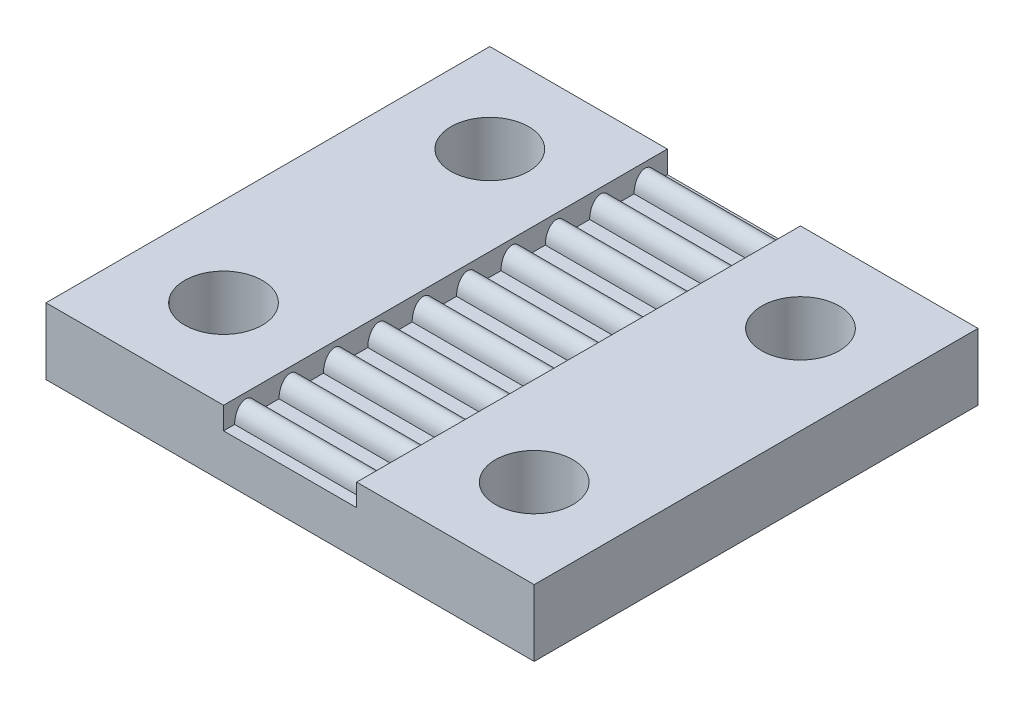
ISO-10303-21;
HEADER;
FILE_DESCRIPTION(('STEP AP214'),'2;1');
FILE_NAME('part.step','',(''),(''),'','','');
FILE_SCHEMA(('AUTOMOTIVE_DESIGN { 1 0 10303 214 1 1 1 1 }'));
ENDSEC;
DATA;
#1=APPLICATION_CONTEXT('core data for automotive mechanical design processes');
#2=APPLICATION_PROTOCOL_DEFINITION('international standard','automotive_design',2000,#1);
#3=PRODUCT_CONTEXT('',#1,'mechanical');
#4=PRODUCT('Part','Part','',(#3));
#5=PRODUCT_RELATED_PRODUCT_CATEGORY('part','',(#4));
#6=PRODUCT_DEFINITION_FORMATION('','',#4);
#7=PRODUCT_DEFINITION_CONTEXT('part definition',#1,'design');
#8=PRODUCT_DEFINITION('design','',#6,#7);
#9=PRODUCT_DEFINITION_SHAPE('','',#8);
#10=(LENGTH_UNIT() NAMED_UNIT(*) SI_UNIT(.MILLI.,.METRE.));
#11=(NAMED_UNIT(*) PLANE_ANGLE_UNIT() SI_UNIT($,.RADIAN.));
#12=(NAMED_UNIT(*) SI_UNIT($,.STERADIAN.) SOLID_ANGLE_UNIT());
#13=UNCERTAINTY_MEASURE_WITH_UNIT(LENGTH_MEASURE(1.E-05),#10,'distance_accuracy_value','');
#14=(GEOMETRIC_REPRESENTATION_CONTEXT(3) GLOBAL_UNCERTAINTY_ASSIGNED_CONTEXT((#13)) GLOBAL_UNIT_ASSIGNED_CONTEXT((#10,
#11,#12)) REPRESENTATION_CONTEXT('',''));
#15=CARTESIAN_POINT('',(0.,0.,0.));
#16=DIRECTION('',(0.,0.,1.));
#17=DIRECTION('',(1.,0.,0.));
#18=AXIS2_PLACEMENT_3D('',#15,#16,#17);
#19=CARTESIAN_POINT('',(-3.,0.,10.));
#20=DIRECTION('',(0.,-1.,0.));
#21=DIRECTION('',(0.,0.,-1.));
#22=AXIS2_PLACEMENT_3D('',#19,#20,#21);
#23=PLANE('',#22);
#24=DIRECTION('',(-1.,0.,0.));
#25=VECTOR('',#24,1.);
#26=CARTESIAN_POINT('',(0.,0.,8.5));
#27=LINE('',#26,#25);
#28=CARTESIAN_POINT('',(3.,0.,8.5));
#29=VERTEX_POINT('',#28);
#30=CARTESIAN_POINT('',(-3.,0.,8.5));
#31=VERTEX_POINT('',#30);
#32=EDGE_CURVE('E50',#29,#31,#27,.T.);
#33=ORIENTED_EDGE('',*,*,#32,.F.);
#34=DIRECTION('',(0.,0.,-1.));
#35=VECTOR('',#34,1.);
#36=CARTESIAN_POINT('',(3.,0.,10.));
#37=LINE('',#36,#35);
#38=CARTESIAN_POINT('',(3.,0.,7.5));
#39=VERTEX_POINT('',#38);
#40=EDGE_CURVE('E413',#29,#39,#37,.T.);
#41=ORIENTED_EDGE('',*,*,#40,.T.);
#42=DIRECTION('',(-1.,0.,0.));
#43=VECTOR('',#42,1.);
#44=CARTESIAN_POINT('',(0.,0.,7.5));
#45=LINE('',#44,#43);
#46=CARTESIAN_POINT('',(-3.,0.,7.5));
#47=VERTEX_POINT('',#46);
#48=EDGE_CURVE('E243',#47,#39,#45,.F.);
#49=ORIENTED_EDGE('',*,*,#48,.F.);
#50=DIRECTION('',(0.,0.,-1.));
#51=VECTOR('',#50,1.);
#52=CARTESIAN_POINT('',(-3.,0.,10.));
#53=LINE('',#52,#51);
#54=EDGE_CURVE('E230',#31,#47,#53,.T.);
#55=ORIENTED_EDGE('',*,*,#54,.F.);
#56=EDGE_LOOP('',(#33,#41,#49,#55));
#57=FACE_BOUND('',#56,.T.);
#58=ADVANCED_FACE('F35',(#57),#23,.F.);
#59=DIRECTION('',(-1.,0.,0.));
#60=VECTOR('',#59,1.);
#61=CARTESIAN_POINT('',(0.,0.,9.5));
#62=LINE('',#61,#60);
#63=CARTESIAN_POINT('',(-3.,0.,9.5));
#64=VERTEX_POINT('',#63);
#65=CARTESIAN_POINT('',(3.,0.,9.5));
#66=VERTEX_POINT('',#65);
#67=EDGE_CURVE('E234',#64,#66,#62,.F.);
#68=ORIENTED_EDGE('',*,*,#67,.F.);
#69=CARTESIAN_POINT('',(-3.,0.,10.));
#70=VERTEX_POINT('',#69);
#71=EDGE_CURVE('E222',#70,#64,#53,.T.);
#72=ORIENTED_EDGE('',*,*,#71,.F.);
#73=DIRECTION('',(-1.,0.,0.));
#74=VECTOR('',#73,1.);
#75=CARTESIAN_POINT('',(-3.,0.,10.));
#76=LINE('',#75,#74);
#77=CARTESIAN_POINT('',(3.,0.,10.));
#78=VERTEX_POINT('',#77);
#79=EDGE_CURVE('E367',#78,#70,#76,.T.);
#80=ORIENTED_EDGE('',*,*,#79,.F.);
#81=EDGE_CURVE('E236',#78,#66,#37,.T.);
#82=ORIENTED_EDGE('',*,*,#81,.T.);
#83=EDGE_LOOP('',(#68,#72,#80,#82));
#84=FACE_BOUND('',#83,.T.);
#85=ADVANCED_FACE('F235',(#84),#23,.F.);
#86=DIRECTION('',(-1.,0.,0.));
#87=VECTOR('',#86,1.);
#88=CARTESIAN_POINT('',(0.,0.,6.5));
#89=LINE('',#88,#87);
#90=CARTESIAN_POINT('',(3.,0.,6.5));
#91=VERTEX_POINT('',#90);
#92=CARTESIAN_POINT('',(-3.,0.,6.5));
#93=VERTEX_POINT('',#92);
#94=EDGE_CURVE('E445',#91,#93,#89,.T.);
#95=ORIENTED_EDGE('',*,*,#94,.F.);
#96=CARTESIAN_POINT('',(3.,0.,5.5));
#97=VERTEX_POINT('',#96);
#98=EDGE_CURVE('E805',#91,#97,#37,.T.);
#99=ORIENTED_EDGE('',*,*,#98,.T.);
#100=DIRECTION('',(-1.,0.,0.));
#101=VECTOR('',#100,1.);
#102=CARTESIAN_POINT('',(0.,0.,5.5));
#103=LINE('',#102,#101);
#104=CARTESIAN_POINT('',(-3.,0.,5.5));
#105=VERTEX_POINT('',#104);
#106=EDGE_CURVE('E269',#105,#97,#103,.F.);
#107=ORIENTED_EDGE('',*,*,#106,.F.);
#108=EDGE_CURVE('E447',#93,#105,#53,.T.);
#109=ORIENTED_EDGE('',*,*,#108,.F.);
#110=EDGE_LOOP('',(#95,#99,#107,#109));
#111=FACE_BOUND('',#110,.T.);
#112=ADVANCED_FACE('F450',(#111),#23,.F.);
#113=DIRECTION('',(-1.,0.,0.));
#114=VECTOR('',#113,1.);
#115=CARTESIAN_POINT('',(0.,0.,4.5));
#116=LINE('',#115,#114);
#117=CARTESIAN_POINT('',(3.,0.,4.5));
#118=VERTEX_POINT('',#117);
#119=CARTESIAN_POINT('',(-3.,0.,4.5));
#120=VERTEX_POINT('',#119);
#121=EDGE_CURVE('E272',#118,#120,#116,.T.);
#122=ORIENTED_EDGE('',*,*,#121,.F.);
#123=CARTESIAN_POINT('',(3.,0.,3.5));
#124=VERTEX_POINT('',#123);
#125=EDGE_CURVE('E493',#118,#124,#37,.T.);
#126=ORIENTED_EDGE('',*,*,#125,.T.);
#127=DIRECTION('',(-1.,0.,0.));
#128=VECTOR('',#127,1.);
#129=CARTESIAN_POINT('',(0.,0.,3.5));
#130=LINE('',#129,#128);
#131=CARTESIAN_POINT('',(-3.,0.,3.5));
#132=VERTEX_POINT('',#131);
#133=EDGE_CURVE('E277',#132,#124,#130,.F.);
#134=ORIENTED_EDGE('',*,*,#133,.F.);
#135=EDGE_CURVE('E452',#120,#132,#53,.T.);
#136=ORIENTED_EDGE('',*,*,#135,.F.);
#137=EDGE_LOOP('',(#122,#126,#134,#136));
#138=FACE_BOUND('',#137,.T.);
#139=ADVANCED_FACE('F564',(#138),#23,.F.);
#140=DIRECTION('',(-1.,0.,0.));
#141=VECTOR('',#140,1.);
#142=CARTESIAN_POINT('',(0.,0.,2.5));
#143=LINE('',#142,#141);
#144=CARTESIAN_POINT('',(3.,0.,2.5));
#145=VERTEX_POINT('',#144);
#146=CARTESIAN_POINT('',(-3.,0.,2.5));
#147=VERTEX_POINT('',#146);
#148=EDGE_CURVE('E282',#145,#147,#143,.T.);
#149=ORIENTED_EDGE('',*,*,#148,.F.);
#150=CARTESIAN_POINT('',(3.,0.,1.5));
#151=VERTEX_POINT('',#150);
#152=EDGE_CURVE('E492',#145,#151,#37,.T.);
#153=ORIENTED_EDGE('',*,*,#152,.T.);
#154=DIRECTION('',(-1.,0.,0.));
#155=VECTOR('',#154,1.);
#156=CARTESIAN_POINT('',(0.,0.,1.5));
#157=LINE('',#156,#155);
#158=CARTESIAN_POINT('',(-3.,0.,1.5));
#159=VERTEX_POINT('',#158);
#160=EDGE_CURVE('E352',#159,#151,#157,.F.);
#161=ORIENTED_EDGE('',*,*,#160,.F.);
#162=EDGE_CURVE('E453',#147,#159,#53,.T.);
#163=ORIENTED_EDGE('',*,*,#162,.F.);
#164=EDGE_LOOP('',(#149,#153,#161,#163));
#165=FACE_BOUND('',#164,.T.);
#166=ADVANCED_FACE('F558',(#165),#23,.F.);
#167=DIRECTION('',(-1.,0.,0.));
#168=VECTOR('',#167,1.);
#169=CARTESIAN_POINT('',(0.,0.,-9.5));
#170=LINE('',#169,#168);
#171=CARTESIAN_POINT('',(3.,0.,-9.5));
#172=VERTEX_POINT('',#171);
#173=CARTESIAN_POINT('',(-3.,0.,-9.5));
#174=VERTEX_POINT('',#173);
#175=EDGE_CURVE('E510',#172,#174,#170,.T.);
#176=ORIENTED_EDGE('',*,*,#175,.F.);
#177=CARTESIAN_POINT('',(3.,0.,-10.));
#178=VERTEX_POINT('',#177);
#179=EDGE_CURVE('E229',#172,#178,#37,.T.);
#180=ORIENTED_EDGE('',*,*,#179,.T.);
#181=DIRECTION('',(-1.,0.,0.));
#182=VECTOR('',#181,1.);
#183=CARTESIAN_POINT('',(-3.,0.,-10.));
#184=LINE('',#183,#182);
#185=CARTESIAN_POINT('',(-3.,0.,-10.));
#186=VERTEX_POINT('',#185);
#187=EDGE_CURVE('E384',#178,#186,#184,.T.);
#188=ORIENTED_EDGE('',*,*,#187,.T.);
#189=EDGE_CURVE('E409',#174,#186,#53,.T.);
#190=ORIENTED_EDGE('',*,*,#189,.F.);
#191=EDGE_LOOP('',(#176,#180,#188,#190));
#192=FACE_BOUND('',#191,.T.);
#193=ADVANCED_FACE('F506',(#192),#23,.F.);
#194=DIRECTION('',(-1.,0.,0.));
#195=VECTOR('',#194,1.);
#196=CARTESIAN_POINT('',(0.,0.,-8.5));
#197=LINE('',#196,#195);
#198=CARTESIAN_POINT('',(-3.,0.,-8.5));
#199=VERTEX_POINT('',#198);
#200=CARTESIAN_POINT('',(3.,0.,-8.5));
#201=VERTEX_POINT('',#200);
#202=EDGE_CURVE('E287',#199,#201,#197,.F.);
#203=ORIENTED_EDGE('',*,*,#202,.F.);
#204=CARTESIAN_POINT('',(-3.,0.,-7.5));
#205=VERTEX_POINT('',#204);
#206=EDGE_CURVE('E459',#205,#199,#53,.T.);
#207=ORIENTED_EDGE('',*,*,#206,.F.);
#208=DIRECTION('',(-1.,0.,0.));
#209=VECTOR('',#208,1.);
#210=CARTESIAN_POINT('',(0.,0.,-7.5));
#211=LINE('',#210,#209);
#212=CARTESIAN_POINT('',(3.,0.,-7.5));
#213=VERTEX_POINT('',#212);
#214=EDGE_CURVE('E310',#213,#205,#211,.T.);
#215=ORIENTED_EDGE('',*,*,#214,.F.);
#216=EDGE_CURVE('E497',#213,#201,#37,.T.);
#217=ORIENTED_EDGE('',*,*,#216,.T.);
#218=EDGE_LOOP('',(#203,#207,#215,#217));
#219=FACE_BOUND('',#218,.T.);
#220=ADVANCED_FACE('F557',(#219),#23,.F.);
#221=DIRECTION('',(-1.,0.,0.));
#222=VECTOR('',#221,1.);
#223=CARTESIAN_POINT('',(0.,0.,-6.5));
#224=LINE('',#223,#222);
#225=CARTESIAN_POINT('',(-3.,0.,-6.5));
#226=VERTEX_POINT('',#225);
#227=CARTESIAN_POINT('',(3.,0.,-6.5));
#228=VERTEX_POINT('',#227);
#229=EDGE_CURVE('E307',#226,#228,#224,.F.);
#230=ORIENTED_EDGE('',*,*,#229,.F.);
#231=CARTESIAN_POINT('',(-3.,0.,-5.5));
#232=VERTEX_POINT('',#231);
#233=EDGE_CURVE('E461',#232,#226,#53,.T.);
#234=ORIENTED_EDGE('',*,*,#233,.F.);
#235=DIRECTION('',(-1.,0.,0.));
#236=VECTOR('',#235,1.);
#237=CARTESIAN_POINT('',(0.,0.,-5.5));
#238=LINE('',#237,#236);
#239=CARTESIAN_POINT('',(3.,0.,-5.5));
#240=VERTEX_POINT('',#239);
#241=EDGE_CURVE('E319',#240,#232,#238,.T.);
#242=ORIENTED_EDGE('',*,*,#241,.F.);
#243=EDGE_CURVE('E495',#240,#228,#37,.T.);
#244=ORIENTED_EDGE('',*,*,#243,.T.);
#245=EDGE_LOOP('',(#230,#234,#242,#244));
#246=FACE_BOUND('',#245,.T.);
#247=ADVANCED_FACE('F563',(#246),#23,.F.);
#248=DIRECTION('',(-1.,0.,0.));
#249=VECTOR('',#248,1.);
#250=CARTESIAN_POINT('',(0.,0.,-4.5));
#251=LINE('',#250,#249);
#252=CARTESIAN_POINT('',(-3.,0.,-4.5));
#253=VERTEX_POINT('',#252);
#254=CARTESIAN_POINT('',(3.,0.,-4.5));
#255=VERTEX_POINT('',#254);
#256=EDGE_CURVE('E314',#253,#255,#251,.F.);
#257=ORIENTED_EDGE('',*,*,#256,.F.);
#258=CARTESIAN_POINT('',(-3.,0.,-3.5));
#259=VERTEX_POINT('',#258);
#260=EDGE_CURVE('E464',#259,#253,#53,.T.);
#261=ORIENTED_EDGE('',*,*,#260,.F.);
#262=DIRECTION('',(-1.,0.,0.));
#263=VECTOR('',#262,1.);
#264=CARTESIAN_POINT('',(0.,0.,-3.5));
#265=LINE('',#264,#263);
#266=CARTESIAN_POINT('',(3.,0.,-3.5));
#267=VERTEX_POINT('',#266);
#268=EDGE_CURVE('E478',#267,#259,#265,.T.);
#269=ORIENTED_EDGE('',*,*,#268,.F.);
#270=EDGE_CURVE('E494',#267,#255,#37,.T.);
#271=ORIENTED_EDGE('',*,*,#270,.T.);
#272=EDGE_LOOP('',(#257,#261,#269,#271));
#273=FACE_BOUND('',#272,.T.);
#274=ADVANCED_FACE('F572',(#273),#23,.F.);
#275=DIRECTION('',(-1.,0.,0.));
#276=VECTOR('',#275,1.);
#277=CARTESIAN_POINT('',(0.,0.,-2.5));
#278=LINE('',#277,#276);
#279=CARTESIAN_POINT('',(-3.,0.,-2.5));
#280=VERTEX_POINT('',#279);
#281=CARTESIAN_POINT('',(3.,0.,-2.5));
#282=VERTEX_POINT('',#281);
#283=EDGE_CURVE('E324',#280,#282,#278,.F.);
#284=ORIENTED_EDGE('',*,*,#283,.F.);
#285=CARTESIAN_POINT('',(-3.,0.,-1.5));
#286=VERTEX_POINT('',#285);
#287=EDGE_CURVE('E458',#286,#280,#53,.T.);
#288=ORIENTED_EDGE('',*,*,#287,.F.);
#289=DIRECTION('',(-1.,0.,0.));
#290=VECTOR('',#289,1.);
#291=CARTESIAN_POINT('',(0.,0.,-1.5));
#292=LINE('',#291,#290);
#293=CARTESIAN_POINT('',(3.,0.,-1.5));
#294=VERTEX_POINT('',#293);
#295=EDGE_CURVE('E347',#294,#286,#292,.T.);
#296=ORIENTED_EDGE('',*,*,#295,.F.);
#297=EDGE_CURVE('E476',#294,#282,#37,.T.);
#298=ORIENTED_EDGE('',*,*,#297,.T.);
#299=EDGE_LOOP('',(#284,#288,#296,#298));
#300=FACE_BOUND('',#299,.T.);
#301=ADVANCED_FACE('F474',(#300),#23,.F.);
#302=DIRECTION('',(-1.,0.,0.));
#303=VECTOR('',#302,1.);
#304=CARTESIAN_POINT('',(0.,0.,-0.5));
#305=LINE('',#304,#303);
#306=CARTESIAN_POINT('',(-3.,0.,-0.5));
#307=VERTEX_POINT('',#306);
#308=CARTESIAN_POINT('',(3.,0.,-0.499999999999999));
#309=VERTEX_POINT('',#308);
#310=EDGE_CURVE('E344',#307,#309,#305,.F.);
#311=ORIENTED_EDGE('',*,*,#310,.F.);
#312=CARTESIAN_POINT('',(-3.,0.,0.499999999999999));
#313=VERTEX_POINT('',#312);
#314=EDGE_CURVE('E232',#313,#307,#53,.T.);
#315=ORIENTED_EDGE('',*,*,#314,.F.);
#316=DIRECTION('',(-1.,0.,0.));
#317=VECTOR('',#316,1.);
#318=CARTESIAN_POINT('',(0.,0.,0.5));
#319=LINE('',#318,#317);
#320=CARTESIAN_POINT('',(3.,0.,0.499999999999999));
#321=VERTEX_POINT('',#320);
#322=EDGE_CURVE('E357',#321,#313,#319,.T.);
#323=ORIENTED_EDGE('',*,*,#322,.F.);
#324=EDGE_CURVE('E414',#321,#309,#37,.T.);
#325=ORIENTED_EDGE('',*,*,#324,.T.);
#326=EDGE_LOOP('',(#311,#315,#323,#325));
#327=FACE_BOUND('',#326,.T.);
#328=ADVANCED_FACE('F490',(#327),#23,.F.);
#329=CARTESIAN_POINT('',(3.,1.,10.));
#330=DIRECTION('',(0.,-1.,0.));
#331=DIRECTION('',(1.,0.,0.));
#332=AXIS2_PLACEMENT_3D('',#329,#330,#331);
#333=PLANE('',#332);
#334=CARTESIAN_POINT('',(7.,1.,6.));
#335=DIRECTION('',(0.,1.,0.));
#336=DIRECTION('',(0.,0.,1.));
#337=AXIS2_PLACEMENT_3D('',#334,#335,#336);
#338=CIRCLE('',#337,1.75);
#339=CARTESIAN_POINT('',(7.,1.,7.75));
#340=VERTEX_POINT('',#339);
#341=EDGE_CURVE('E823',#340,#340,#338,.T.);
#342=ORIENTED_EDGE('',*,*,#341,.F.);
#343=EDGE_LOOP('',(#342));
#344=FACE_BOUND('',#343,.T.);
#345=CARTESIAN_POINT('',(7.,1.,-6.));
#346=DIRECTION('',(0.,1.,0.));
#347=DIRECTION('',(0.,0.,1.));
#348=AXIS2_PLACEMENT_3D('',#345,#346,#347);
#349=CIRCLE('',#348,1.75);
#350=CARTESIAN_POINT('',(7.,1.,-4.25));
#351=VERTEX_POINT('',#350);
#352=EDGE_CURVE('E830',#351,#351,#349,.T.);
#353=ORIENTED_EDGE('',*,*,#352,.F.);
#354=EDGE_LOOP('',(#353));
#355=FACE_BOUND('',#354,.T.);
#356=DIRECTION('',(-1.,0.,0.));
#357=VECTOR('',#356,1.);
#358=CARTESIAN_POINT('',(3.,1.,-10.));
#359=LINE('',#358,#357);
#360=CARTESIAN_POINT('',(11.,1.,-10.));
#361=VERTEX_POINT('',#360);
#362=CARTESIAN_POINT('',(3.,1.,-10.));
#363=VERTEX_POINT('',#362);
#364=EDGE_CURVE('E360',#361,#363,#359,.T.);
#365=ORIENTED_EDGE('',*,*,#364,.T.);
#366=DIRECTION('',(0.,0.,-1.));
#367=VECTOR('',#366,1.);
#368=CARTESIAN_POINT('',(3.,1.,10.));
#369=LINE('',#368,#367);
#370=CARTESIAN_POINT('',(3.,1.,10.));
#371=VERTEX_POINT('',#370);
#372=EDGE_CURVE('E412',#371,#363,#369,.T.);
#373=ORIENTED_EDGE('',*,*,#372,.F.);
#374=DIRECTION('',(-1.,0.,0.));
#375=VECTOR('',#374,1.);
#376=CARTESIAN_POINT('',(3.,1.,10.));
#377=LINE('',#376,#375);
#378=CARTESIAN_POINT('',(11.,1.,10.));
#379=VERTEX_POINT('',#378);
#380=EDGE_CURVE('E361',#379,#371,#377,.T.);
#381=ORIENTED_EDGE('',*,*,#380,.F.);
#382=DIRECTION('',(0.,0.,-1.));
#383=VECTOR('',#382,1.);
#384=CARTESIAN_POINT('',(11.,1.,10.));
#385=LINE('',#384,#383);
#386=EDGE_CURVE('E378',#379,#361,#385,.T.);
#387=ORIENTED_EDGE('',*,*,#386,.T.);
#388=EDGE_LOOP('',(#365,#373,#381,#387));
#389=FACE_BOUND('',#388,.T.);
#390=ADVANCED_FACE('F37',(#344,#355,#389),#333,.F.);
#391=CARTESIAN_POINT('',(3.,1.,10.));
#392=DIRECTION('',(1.,0.,0.));
#393=DIRECTION('',(0.,0.,-1.));
#394=AXIS2_PLACEMENT_3D('',#391,#392,#393);
#395=PLANE('',#394);
#396=CARTESIAN_POINT('',(3.,0.,9.));
#397=DIRECTION('',(1.,0.,0.));
#398=DIRECTION('',(0.,1.,0.));
#399=AXIS2_PLACEMENT_3D('',#396,#397,#398);
#400=ELLIPSE('',#399,0.75,0.5);
#401=EDGE_CURVE('E57',#29,#66,#400,.T.);
#402=ORIENTED_EDGE('',*,*,#401,.T.);
#403=ORIENTED_EDGE('',*,*,#81,.F.);
#404=DIRECTION('',(0.,-1.,0.));
#405=VECTOR('',#404,1.);
#406=CARTESIAN_POINT('',(3.,1.,10.));
#407=LINE('',#406,#405);
#408=EDGE_CURVE('E364',#371,#78,#407,.T.);
#409=ORIENTED_EDGE('',*,*,#408,.F.);
#410=ORIENTED_EDGE('',*,*,#372,.T.);
#411=DIRECTION('',(0.,-1.,0.));
#412=VECTOR('',#411,1.);
#413=CARTESIAN_POINT('',(3.,1.,-10.));
#414=LINE('',#413,#412);
#415=EDGE_CURVE('E381',#363,#178,#414,.T.);
#416=ORIENTED_EDGE('',*,*,#415,.T.);
#417=ORIENTED_EDGE('',*,*,#179,.F.);
#418=CARTESIAN_POINT('',(3.,0.,-9.));
#419=DIRECTION('',(1.,0.,0.));
#420=DIRECTION('',(0.,1.,0.));
#421=AXIS2_PLACEMENT_3D('',#418,#419,#420);
#422=ELLIPSE('',#421,0.75,0.5);
#423=EDGE_CURVE('E285',#172,#201,#422,.T.);
#424=ORIENTED_EDGE('',*,*,#423,.T.);
#425=ORIENTED_EDGE('',*,*,#216,.F.);
#426=CARTESIAN_POINT('',(3.,0.,-7.));
#427=DIRECTION('',(1.,0.,0.));
#428=DIRECTION('',(0.,1.,0.));
#429=AXIS2_PLACEMENT_3D('',#426,#427,#428);
#430=ELLIPSE('',#429,0.75,0.5);
#431=EDGE_CURVE('E306',#213,#228,#430,.T.);
#432=ORIENTED_EDGE('',*,*,#431,.T.);
#433=ORIENTED_EDGE('',*,*,#243,.F.);
#434=CARTESIAN_POINT('',(3.,0.,-5.));
#435=DIRECTION('',(1.,0.,0.));
#436=DIRECTION('',(0.,1.,0.));
#437=AXIS2_PLACEMENT_3D('',#434,#435,#436);
#438=ELLIPSE('',#437,0.75,0.5);
#439=EDGE_CURVE('E313',#240,#255,#438,.T.);
#440=ORIENTED_EDGE('',*,*,#439,.T.);
#441=ORIENTED_EDGE('',*,*,#270,.F.);
#442=CARTESIAN_POINT('',(3.,0.,-3.));
#443=DIRECTION('',(1.,0.,0.));
#444=DIRECTION('',(0.,1.,0.));
#445=AXIS2_PLACEMENT_3D('',#442,#443,#444);
#446=ELLIPSE('',#445,0.75,0.5);
#447=EDGE_CURVE('E322',#267,#282,#446,.T.);
#448=ORIENTED_EDGE('',*,*,#447,.T.);
#449=ORIENTED_EDGE('',*,*,#297,.F.);
#450=CARTESIAN_POINT('',(3.,0.,-1.));
#451=DIRECTION('',(1.,0.,0.));
#452=DIRECTION('',(0.,1.,0.));
#453=AXIS2_PLACEMENT_3D('',#450,#451,#452);
#454=ELLIPSE('',#453,0.75,0.5);
#455=EDGE_CURVE('E343',#294,#309,#454,.T.);
#456=ORIENTED_EDGE('',*,*,#455,.T.);
#457=ORIENTED_EDGE('',*,*,#324,.F.);
#458=CARTESIAN_POINT('',(3.,0.,1.));
#459=DIRECTION('',(1.,0.,0.));
#460=DIRECTION('',(0.,1.,0.));
#461=AXIS2_PLACEMENT_3D('',#458,#459,#460);
#462=ELLIPSE('',#461,0.75,0.5);
#463=EDGE_CURVE('E350',#321,#151,#462,.T.);
#464=ORIENTED_EDGE('',*,*,#463,.T.);
#465=ORIENTED_EDGE('',*,*,#152,.F.);
#466=CARTESIAN_POINT('',(3.,0.,3.));
#467=DIRECTION('',(1.,0.,0.));
#468=DIRECTION('',(0.,1.,0.));
#469=AXIS2_PLACEMENT_3D('',#466,#467,#468);
#470=ELLIPSE('',#469,0.75,0.5);
#471=EDGE_CURVE('E275',#145,#124,#470,.T.);
#472=ORIENTED_EDGE('',*,*,#471,.T.);
#473=ORIENTED_EDGE('',*,*,#125,.F.);
#474=CARTESIAN_POINT('',(3.,0.,5.));
#475=DIRECTION('',(1.,0.,0.));
#476=DIRECTION('',(0.,1.,0.));
#477=AXIS2_PLACEMENT_3D('',#474,#475,#476);
#478=ELLIPSE('',#477,0.75,0.5);
#479=EDGE_CURVE('E268',#118,#97,#478,.T.);
#480=ORIENTED_EDGE('',*,*,#479,.T.);
#481=ORIENTED_EDGE('',*,*,#98,.F.);
#482=CARTESIAN_POINT('',(3.,0.,7.));
#483=DIRECTION('',(1.,0.,0.));
#484=DIRECTION('',(0.,1.,0.));
#485=AXIS2_PLACEMENT_3D('',#482,#483,#484);
#486=ELLIPSE('',#485,0.75,0.5);
#487=EDGE_CURVE('E240',#91,#39,#486,.T.);
#488=ORIENTED_EDGE('',*,*,#487,.T.);
#489=ORIENTED_EDGE('',*,*,#40,.F.);
#490=EDGE_LOOP('',(#402,#403,#409,#410,#416,#417,#424,#425,#432,#433,#440,#441,#448,#449,#456,
#457,#464,#465,#472,#473,#480,#481,#488,#489));
#491=FACE_BOUND('',#490,.T.);
#492=ADVANCED_FACE('F486',(#491),#395,.F.);
#493=CARTESIAN_POINT('',(-3.,1.,10.));
#494=DIRECTION('',(-1.,0.,0.));
#495=DIRECTION('',(0.,0.,1.));
#496=AXIS2_PLACEMENT_3D('',#493,#494,#495);
#497=PLANE('',#496);
#498=CARTESIAN_POINT('',(-3.,0.,9.));
#499=DIRECTION('',(1.,0.,0.));
#500=DIRECTION('',(0.,1.,0.));
#501=AXIS2_PLACEMENT_3D('',#498,#499,#500);
#502=ELLIPSE('',#501,0.75,0.5);
#503=EDGE_CURVE('E11',#31,#64,#502,.T.);
#504=ORIENTED_EDGE('',*,*,#503,.F.);
#505=ORIENTED_EDGE('',*,*,#54,.T.);
#506=CARTESIAN_POINT('',(-3.,0.,7.));
#507=DIRECTION('',(1.,0.,0.));
#508=DIRECTION('',(0.,1.,0.));
#509=AXIS2_PLACEMENT_3D('',#506,#507,#508);
#510=ELLIPSE('',#509,0.75,0.5);
#511=EDGE_CURVE('E43',#93,#47,#510,.T.);
#512=ORIENTED_EDGE('',*,*,#511,.F.);
#513=ORIENTED_EDGE('',*,*,#108,.T.);
#514=CARTESIAN_POINT('',(-3.,0.,5.));
#515=DIRECTION('',(1.,0.,0.));
#516=DIRECTION('',(0.,1.,0.));
#517=AXIS2_PLACEMENT_3D('',#514,#515,#516);
#518=ELLIPSE('',#517,0.75,0.5);
#519=EDGE_CURVE('E438',#120,#105,#518,.T.);
#520=ORIENTED_EDGE('',*,*,#519,.F.);
#521=ORIENTED_EDGE('',*,*,#135,.T.);
#522=CARTESIAN_POINT('',(-3.,0.,3.));
#523=DIRECTION('',(1.,0.,0.));
#524=DIRECTION('',(0.,1.,0.));
#525=AXIS2_PLACEMENT_3D('',#522,#523,#524);
#526=ELLIPSE('',#525,0.75,0.5);
#527=EDGE_CURVE('E435',#147,#132,#526,.T.);
#528=ORIENTED_EDGE('',*,*,#527,.F.);
#529=ORIENTED_EDGE('',*,*,#162,.T.);
#530=CARTESIAN_POINT('',(-3.,0.,1.));
#531=DIRECTION('',(1.,0.,0.));
#532=DIRECTION('',(0.,1.,0.));
#533=AXIS2_PLACEMENT_3D('',#530,#531,#532);
#534=ELLIPSE('',#533,0.75,0.5);
#535=EDGE_CURVE('E417',#313,#159,#534,.T.);
#536=ORIENTED_EDGE('',*,*,#535,.F.);
#537=ORIENTED_EDGE('',*,*,#314,.T.);
#538=CARTESIAN_POINT('',(-3.,0.,-1.));
#539=DIRECTION('',(1.,0.,0.));
#540=DIRECTION('',(0.,1.,0.));
#541=AXIS2_PLACEMENT_3D('',#538,#539,#540);
#542=ELLIPSE('',#541,0.75,0.5);
#543=EDGE_CURVE('E420',#286,#307,#542,.T.);
#544=ORIENTED_EDGE('',*,*,#543,.F.);
#545=ORIENTED_EDGE('',*,*,#287,.T.);
#546=CARTESIAN_POINT('',(-3.,0.,-3.));
#547=DIRECTION('',(1.,0.,0.));
#548=DIRECTION('',(0.,1.,0.));
#549=AXIS2_PLACEMENT_3D('',#546,#547,#548);
#550=ELLIPSE('',#549,0.75,0.5);
#551=EDGE_CURVE('E423',#259,#280,#550,.T.);
#552=ORIENTED_EDGE('',*,*,#551,.F.);
#553=ORIENTED_EDGE('',*,*,#260,.T.);
#554=CARTESIAN_POINT('',(-3.,0.,-5.));
#555=DIRECTION('',(1.,0.,0.));
#556=DIRECTION('',(0.,1.,0.));
#557=AXIS2_PLACEMENT_3D('',#554,#555,#556);
#558=ELLIPSE('',#557,0.75,0.5);
#559=EDGE_CURVE('E426',#232,#253,#558,.T.);
#560=ORIENTED_EDGE('',*,*,#559,.F.);
#561=ORIENTED_EDGE('',*,*,#233,.T.);
#562=CARTESIAN_POINT('',(-3.,0.,-7.));
#563=DIRECTION('',(1.,0.,0.));
#564=DIRECTION('',(0.,1.,0.));
#565=AXIS2_PLACEMENT_3D('',#562,#563,#564);
#566=ELLIPSE('',#565,0.75,0.5);
#567=EDGE_CURVE('E429',#205,#226,#566,.T.);
#568=ORIENTED_EDGE('',*,*,#567,.F.);
#569=ORIENTED_EDGE('',*,*,#206,.T.);
#570=CARTESIAN_POINT('',(-3.,0.,-9.));
#571=DIRECTION('',(1.,0.,0.));
#572=DIRECTION('',(0.,1.,0.));
#573=AXIS2_PLACEMENT_3D('',#570,#571,#572);
#574=ELLIPSE('',#573,0.75,0.5);
#575=EDGE_CURVE('E432',#174,#199,#574,.T.);
#576=ORIENTED_EDGE('',*,*,#575,.F.);
#577=ORIENTED_EDGE('',*,*,#189,.T.);
#578=DIRECTION('',(0.,1.,0.));
#579=VECTOR('',#578,1.);
#580=CARTESIAN_POINT('',(-3.,1.,-10.));
#581=LINE('',#580,#579);
#582=CARTESIAN_POINT('',(-3.,1.,-10.));
#583=VERTEX_POINT('',#582);
#584=EDGE_CURVE('E387',#186,#583,#581,.T.);
#585=ORIENTED_EDGE('',*,*,#584,.T.);
#586=DIRECTION('',(0.,0.,-1.));
#587=VECTOR('',#586,1.);
#588=CARTESIAN_POINT('',(-3.,1.,10.));
#589=LINE('',#588,#587);
#590=CARTESIAN_POINT('',(-3.,1.,10.));
#591=VERTEX_POINT('',#590);
#592=EDGE_CURVE('E407',#591,#583,#589,.T.);
#593=ORIENTED_EDGE('',*,*,#592,.F.);
#594=DIRECTION('',(0.,1.,0.));
#595=VECTOR('',#594,1.);
#596=CARTESIAN_POINT('',(-3.,1.,10.));
#597=LINE('',#596,#595);
#598=EDGE_CURVE('E226',#70,#591,#597,.T.);
#599=ORIENTED_EDGE('',*,*,#598,.F.);
#600=ORIENTED_EDGE('',*,*,#71,.T.);
#601=EDGE_LOOP('',(#504,#505,#512,#513,#520,#521,#528,#529,#536,#537,#544,#545,#552,#553,#560,
#561,#568,#569,#576,#577,#585,#593,#599,#600));
#602=FACE_BOUND('',#601,.T.);
#603=ADVANCED_FACE('F224',(#602),#497,.F.);
#604=CARTESIAN_POINT('',(-11.,1.,10.));
#605=DIRECTION('',(0.,-1.,0.));
#606=DIRECTION('',(0.,0.,-1.));
#607=AXIS2_PLACEMENT_3D('',#604,#605,#606);
#608=PLANE('',#607);
#609=CARTESIAN_POINT('',(-7.,1.,6.));
#610=DIRECTION('',(0.,1.,0.));
#611=DIRECTION('',(0.,0.,1.));
#612=AXIS2_PLACEMENT_3D('',#609,#610,#611);
#613=CIRCLE('',#612,1.75);
#614=CARTESIAN_POINT('',(-7.,1.,7.75));
#615=VERTEX_POINT('',#614);
#616=EDGE_CURVE('E815',#615,#615,#613,.T.);
#617=ORIENTED_EDGE('',*,*,#616,.F.);
#618=EDGE_LOOP('',(#617));
#619=FACE_BOUND('',#618,.T.);
#620=CARTESIAN_POINT('',(-7.,1.,-6.));
#621=DIRECTION('',(0.,1.,0.));
#622=DIRECTION('',(0.,0.,1.));
#623=AXIS2_PLACEMENT_3D('',#620,#621,#622);
#624=CIRCLE('',#623,1.75);
#625=CARTESIAN_POINT('',(-7.,1.,-4.25));
#626=VERTEX_POINT('',#625);
#627=EDGE_CURVE('E829',#626,#626,#624,.T.);
#628=ORIENTED_EDGE('',*,*,#627,.F.);
#629=EDGE_LOOP('',(#628));
#630=FACE_BOUND('',#629,.T.);
#631=DIRECTION('',(-1.,0.,0.));
#632=VECTOR('',#631,1.);
#633=CARTESIAN_POINT('',(-11.,1.,-10.));
#634=LINE('',#633,#632);
#635=CARTESIAN_POINT('',(-11.,1.,-10.));
#636=VERTEX_POINT('',#635);
#637=EDGE_CURVE('E389',#583,#636,#634,.T.);
#638=ORIENTED_EDGE('',*,*,#637,.T.);
#639=DIRECTION('',(0.,0.,-1.));
#640=VECTOR('',#639,1.);
#641=CARTESIAN_POINT('',(-11.,1.,10.));
#642=LINE('',#641,#640);
#643=CARTESIAN_POINT('',(-11.,1.,10.));
#644=VERTEX_POINT('',#643);
#645=EDGE_CURVE('E404',#644,#636,#642,.T.);
#646=ORIENTED_EDGE('',*,*,#645,.F.);
#647=DIRECTION('',(-1.,0.,0.));
#648=VECTOR('',#647,1.);
#649=CARTESIAN_POINT('',(-11.,1.,10.));
#650=LINE('',#649,#648);
#651=EDGE_CURVE('E370',#591,#644,#650,.T.);
#652=ORIENTED_EDGE('',*,*,#651,.F.);
#653=ORIENTED_EDGE('',*,*,#592,.T.);
#654=EDGE_LOOP('',(#638,#646,#652,#653));
#655=FACE_BOUND('',#654,.T.);
#656=ADVANCED_FACE('F520',(#619,#630,#655),#608,.F.);
#657=CARTESIAN_POINT('',(-11.,-2.,10.));
#658=DIRECTION('',(1.,0.,0.));
#659=DIRECTION('',(0.,0.,-1.));
#660=AXIS2_PLACEMENT_3D('',#657,#658,#659);
#661=PLANE('',#660);
#662=DIRECTION('',(0.,-1.,0.));
#663=VECTOR('',#662,1.);
#664=CARTESIAN_POINT('',(-11.,-2.,-10.));
#665=LINE('',#664,#663);
#666=CARTESIAN_POINT('',(-11.,-2.,-10.));
#667=VERTEX_POINT('',#666);
#668=EDGE_CURVE('E391',#636,#667,#665,.T.);
#669=ORIENTED_EDGE('',*,*,#668,.T.);
#670=DIRECTION('',(0.,0.,-1.));
#671=VECTOR('',#670,1.);
#672=CARTESIAN_POINT('',(-11.,-2.,10.));
#673=LINE('',#672,#671);
#674=CARTESIAN_POINT('',(-11.,-2.,10.));
#675=VERTEX_POINT('',#674);
#676=EDGE_CURVE('E401',#675,#667,#673,.T.);
#677=ORIENTED_EDGE('',*,*,#676,.F.);
#678=DIRECTION('',(0.,-1.,0.));
#679=VECTOR('',#678,1.);
#680=CARTESIAN_POINT('',(-11.,-2.,10.));
#681=LINE('',#680,#679);
#682=EDGE_CURVE('E372',#644,#675,#681,.T.);
#683=ORIENTED_EDGE('',*,*,#682,.F.);
#684=ORIENTED_EDGE('',*,*,#645,.T.);
#685=EDGE_LOOP('',(#669,#677,#683,#684));
#686=FACE_BOUND('',#685,.T.);
#687=ADVANCED_FACE('F539',(#686),#661,.F.);
#688=CARTESIAN_POINT('',(-11.,-2.,10.));
#689=DIRECTION('',(0.,1.,0.));
#690=DIRECTION('',(0.,0.,1.));
#691=AXIS2_PLACEMENT_3D('',#688,#689,#690);
#692=PLANE('',#691);
#693=CARTESIAN_POINT('',(-7.,-2.,6.));
#694=DIRECTION('',(0.,1.,0.));
#695=DIRECTION('',(0.,0.,1.));
#696=AXIS2_PLACEMENT_3D('',#693,#694,#695);
#697=CIRCLE('',#696,1.75);
#698=CARTESIAN_POINT('',(-7.,-2.,7.75));
#699=VERTEX_POINT('',#698);
#700=EDGE_CURVE('E818',#699,#699,#697,.T.);
#701=ORIENTED_EDGE('',*,*,#700,.T.);
#702=EDGE_LOOP('',(#701));
#703=FACE_BOUND('',#702,.T.);
#704=CARTESIAN_POINT('',(7.,-2.,6.));
#705=DIRECTION('',(0.,1.,0.));
#706=DIRECTION('',(0.,0.,1.));
#707=AXIS2_PLACEMENT_3D('',#704,#705,#706);
#708=CIRCLE('',#707,1.75);
#709=CARTESIAN_POINT('',(7.,-2.,7.75));
#710=VERTEX_POINT('',#709);
#711=EDGE_CURVE('E820',#710,#710,#708,.T.);
#712=ORIENTED_EDGE('',*,*,#711,.T.);
#713=EDGE_LOOP('',(#712));
#714=FACE_BOUND('',#713,.T.);
#715=CARTESIAN_POINT('',(7.,-2.,-6.));
#716=DIRECTION('',(0.,1.,0.));
#717=DIRECTION('',(0.,0.,1.));
#718=AXIS2_PLACEMENT_3D('',#715,#716,#717);
#719=CIRCLE('',#718,1.75);
#720=CARTESIAN_POINT('',(7.,-2.,-4.25));
#721=VERTEX_POINT('',#720);
#722=EDGE_CURVE('E840',#721,#721,#719,.T.);
#723=ORIENTED_EDGE('',*,*,#722,.T.);
#724=EDGE_LOOP('',(#723));
#725=FACE_BOUND('',#724,.T.);
#726=CARTESIAN_POINT('',(-7.,-2.,-6.));
#727=DIRECTION('',(0.,1.,0.));
#728=DIRECTION('',(0.,0.,1.));
#729=AXIS2_PLACEMENT_3D('',#726,#727,#728);
#730=CIRCLE('',#729,1.75);
#731=CARTESIAN_POINT('',(-7.,-2.,-4.25));
#732=VERTEX_POINT('',#731);
#733=EDGE_CURVE('E826',#732,#732,#730,.T.);
#734=ORIENTED_EDGE('',*,*,#733,.T.);
#735=EDGE_LOOP('',(#734));
#736=FACE_BOUND('',#735,.T.);
#737=DIRECTION('',(1.,0.,0.));
#738=VECTOR('',#737,1.);
#739=CARTESIAN_POINT('',(-11.,-2.,-10.));
#740=LINE('',#739,#738);
#741=CARTESIAN_POINT('',(11.,-2.,-10.));
#742=VERTEX_POINT('',#741);
#743=EDGE_CURVE('E393',#667,#742,#740,.T.);
#744=ORIENTED_EDGE('',*,*,#743,.T.);
#745=DIRECTION('',(0.,0.,-1.));
#746=VECTOR('',#745,1.);
#747=CARTESIAN_POINT('',(11.,-2.,10.));
#748=LINE('',#747,#746);
#749=CARTESIAN_POINT('',(11.,-2.,10.));
#750=VERTEX_POINT('',#749);
#751=EDGE_CURVE('E398',#750,#742,#748,.T.);
#752=ORIENTED_EDGE('',*,*,#751,.F.);
#753=DIRECTION('',(1.,0.,0.));
#754=VECTOR('',#753,1.);
#755=CARTESIAN_POINT('',(-11.,-2.,10.));
#756=LINE('',#755,#754);
#757=EDGE_CURVE('E374',#675,#750,#756,.T.);
#758=ORIENTED_EDGE('',*,*,#757,.F.);
#759=ORIENTED_EDGE('',*,*,#676,.T.);
#760=EDGE_LOOP('',(#744,#752,#758,#759));
#761=FACE_BOUND('',#760,.T.);
#762=ADVANCED_FACE('F537',(#703,#714,#725,#736,#761),#692,.F.);
#763=CARTESIAN_POINT('',(11.,-2.,10.));
#764=DIRECTION('',(-1.,0.,0.));
#765=DIRECTION('',(0.,0.,1.));
#766=AXIS2_PLACEMENT_3D('',#763,#764,#765);
#767=PLANE('',#766);
#768=DIRECTION('',(0.,1.,0.));
#769=VECTOR('',#768,1.);
#770=CARTESIAN_POINT('',(11.,-2.,-10.));
#771=LINE('',#770,#769);
#772=EDGE_CURVE('E365',#742,#361,#771,.T.);
#773=ORIENTED_EDGE('',*,*,#772,.T.);
#774=ORIENTED_EDGE('',*,*,#386,.F.);
#775=DIRECTION('',(0.,1.,0.));
#776=VECTOR('',#775,1.);
#777=CARTESIAN_POINT('',(11.,-2.,10.));
#778=LINE('',#777,#776);
#779=EDGE_CURVE('E376',#750,#379,#778,.T.);
#780=ORIENTED_EDGE('',*,*,#779,.F.);
#781=ORIENTED_EDGE('',*,*,#751,.T.);
#782=EDGE_LOOP('',(#773,#774,#780,#781));
#783=FACE_BOUND('',#782,.T.);
#784=ADVANCED_FACE('F533',(#783),#767,.F.);
#785=CARTESIAN_POINT('',(0.,0.,10.));
#786=DIRECTION('',(0.,0.,1.));
#787=DIRECTION('',(1.,0.,0.));
#788=AXIS2_PLACEMENT_3D('',#785,#786,#787);
#789=PLANE('',#788);
#790=ORIENTED_EDGE('',*,*,#380,.T.);
#791=ORIENTED_EDGE('',*,*,#408,.T.);
#792=ORIENTED_EDGE('',*,*,#79,.T.);
#793=ORIENTED_EDGE('',*,*,#598,.T.);
#794=ORIENTED_EDGE('',*,*,#651,.T.);
#795=ORIENTED_EDGE('',*,*,#682,.T.);
#796=ORIENTED_EDGE('',*,*,#757,.T.);
#797=ORIENTED_EDGE('',*,*,#779,.T.);
#798=EDGE_LOOP('',(#790,#791,#792,#793,#794,#795,#796,#797));
#799=FACE_BOUND('',#798,.T.);
#800=ADVANCED_FACE('F524',(#799),#789,.T.);
#801=CARTESIAN_POINT('',(0.,0.,-10.));
#802=DIRECTION('',(0.,0.,1.));
#803=DIRECTION('',(1.,0.,0.));
#804=AXIS2_PLACEMENT_3D('',#801,#802,#803);
#805=PLANE('',#804);
#806=ORIENTED_EDGE('',*,*,#364,.F.);
#807=ORIENTED_EDGE('',*,*,#772,.F.);
#808=ORIENTED_EDGE('',*,*,#743,.F.);
#809=ORIENTED_EDGE('',*,*,#668,.F.);
#810=ORIENTED_EDGE('',*,*,#637,.F.);
#811=ORIENTED_EDGE('',*,*,#584,.F.);
#812=ORIENTED_EDGE('',*,*,#187,.F.);
#813=ORIENTED_EDGE('',*,*,#415,.F.);
#814=EDGE_LOOP('',(#806,#807,#808,#809,#810,#811,#812,#813));
#815=FACE_BOUND('',#814,.T.);
#816=ADVANCED_FACE('F515',(#815),#805,.F.);
#817=CARTESIAN_POINT('',(4.802775637732,0.,1.));
#818=DIRECTION('',(1.,0.,0.));
#819=DIRECTION('',(0.,1.,0.));
#820=AXIS2_PLACEMENT_3D('',#817,#818,#819);
#821=ELLIPSE('',#820,0.75,0.5);
#822=DIRECTION('',(-1.,0.,0.));
#823=VECTOR('',#822,1.);
#824=SURFACE_OF_LINEAR_EXTRUSION('',#821,#823);
#825=ORIENTED_EDGE('',*,*,#463,.F.);
#826=ORIENTED_EDGE('',*,*,#322,.T.);
#827=ORIENTED_EDGE('',*,*,#535,.T.);
#828=ORIENTED_EDGE('',*,*,#160,.T.);
#829=EDGE_LOOP('',(#825,#826,#827,#828));
#830=FACE_BOUND('',#829,.T.);
#831=ADVANCED_FACE('F336',(#830),#824,.F.);
#832=CARTESIAN_POINT('',(4.802775637732,0.,-1.));
#833=DIRECTION('',(1.,0.,0.));
#834=DIRECTION('',(0.,1.,0.));
#835=AXIS2_PLACEMENT_3D('',#832,#833,#834);
#836=ELLIPSE('',#835,0.75,0.5);
#837=DIRECTION('',(-1.,0.,0.));
#838=VECTOR('',#837,1.);
#839=SURFACE_OF_LINEAR_EXTRUSION('',#836,#838);
#840=ORIENTED_EDGE('',*,*,#455,.F.);
#841=ORIENTED_EDGE('',*,*,#295,.T.);
#842=ORIENTED_EDGE('',*,*,#543,.T.);
#843=ORIENTED_EDGE('',*,*,#310,.T.);
#844=EDGE_LOOP('',(#840,#841,#842,#843));
#845=FACE_BOUND('',#844,.T.);
#846=ADVANCED_FACE('F331',(#845),#839,.F.);
#847=CARTESIAN_POINT('',(4.802775637732,0.,-3.));
#848=DIRECTION('',(1.,0.,0.));
#849=DIRECTION('',(0.,1.,0.));
#850=AXIS2_PLACEMENT_3D('',#847,#848,#849);
#851=ELLIPSE('',#850,0.75,0.5);
#852=DIRECTION('',(-1.,0.,0.));
#853=VECTOR('',#852,1.);
#854=SURFACE_OF_LINEAR_EXTRUSION('',#851,#853);
#855=ORIENTED_EDGE('',*,*,#447,.F.);
#856=ORIENTED_EDGE('',*,*,#268,.T.);
#857=ORIENTED_EDGE('',*,*,#551,.T.);
#858=ORIENTED_EDGE('',*,*,#283,.T.);
#859=EDGE_LOOP('',(#855,#856,#857,#858));
#860=FACE_BOUND('',#859,.T.);
#861=ADVANCED_FACE('F328',(#860),#854,.F.);
#862=CARTESIAN_POINT('',(4.802775637732,0.,-5.));
#863=DIRECTION('',(1.,0.,0.));
#864=DIRECTION('',(0.,1.,0.));
#865=AXIS2_PLACEMENT_3D('',#862,#863,#864);
#866=ELLIPSE('',#865,0.75,0.5);
#867=DIRECTION('',(-1.,0.,0.));
#868=VECTOR('',#867,1.);
#869=SURFACE_OF_LINEAR_EXTRUSION('',#866,#868);
#870=ORIENTED_EDGE('',*,*,#439,.F.);
#871=ORIENTED_EDGE('',*,*,#241,.T.);
#872=ORIENTED_EDGE('',*,*,#559,.T.);
#873=ORIENTED_EDGE('',*,*,#256,.T.);
#874=EDGE_LOOP('',(#870,#871,#872,#873));
#875=FACE_BOUND('',#874,.T.);
#876=ADVANCED_FACE('F299',(#875),#869,.F.);
#877=CARTESIAN_POINT('',(4.802775637732,0.,-7.));
#878=DIRECTION('',(1.,0.,0.));
#879=DIRECTION('',(0.,1.,0.));
#880=AXIS2_PLACEMENT_3D('',#877,#878,#879);
#881=ELLIPSE('',#880,0.75,0.5);
#882=DIRECTION('',(-1.,0.,0.));
#883=VECTOR('',#882,1.);
#884=SURFACE_OF_LINEAR_EXTRUSION('',#881,#883);
#885=ORIENTED_EDGE('',*,*,#431,.F.);
#886=ORIENTED_EDGE('',*,*,#214,.T.);
#887=ORIENTED_EDGE('',*,*,#567,.T.);
#888=ORIENTED_EDGE('',*,*,#229,.T.);
#889=EDGE_LOOP('',(#885,#886,#887,#888));
#890=FACE_BOUND('',#889,.T.);
#891=ADVANCED_FACE('F294',(#890),#884,.F.);
#892=CARTESIAN_POINT('',(4.802775637732,0.,-9.));
#893=DIRECTION('',(1.,0.,0.));
#894=DIRECTION('',(0.,1.,0.));
#895=AXIS2_PLACEMENT_3D('',#892,#893,#894);
#896=ELLIPSE('',#895,0.75,0.5);
#897=DIRECTION('',(-1.,0.,0.));
#898=VECTOR('',#897,1.);
#899=SURFACE_OF_LINEAR_EXTRUSION('',#896,#898);
#900=ORIENTED_EDGE('',*,*,#423,.F.);
#901=ORIENTED_EDGE('',*,*,#175,.T.);
#902=ORIENTED_EDGE('',*,*,#575,.T.);
#903=ORIENTED_EDGE('',*,*,#202,.T.);
#904=EDGE_LOOP('',(#900,#901,#902,#903));
#905=FACE_BOUND('',#904,.T.);
#906=ADVANCED_FACE('F291',(#905),#899,.F.);
#907=CARTESIAN_POINT('',(4.802775637732,0.,3.));
#908=DIRECTION('',(1.,0.,0.));
#909=DIRECTION('',(0.,1.,0.));
#910=AXIS2_PLACEMENT_3D('',#907,#908,#909);
#911=ELLIPSE('',#910,0.75,0.5);
#912=DIRECTION('',(-1.,0.,0.));
#913=VECTOR('',#912,1.);
#914=SURFACE_OF_LINEAR_EXTRUSION('',#911,#913);
#915=ORIENTED_EDGE('',*,*,#471,.F.);
#916=ORIENTED_EDGE('',*,*,#148,.T.);
#917=ORIENTED_EDGE('',*,*,#527,.T.);
#918=ORIENTED_EDGE('',*,*,#133,.T.);
#919=EDGE_LOOP('',(#915,#916,#917,#918));
#920=FACE_BOUND('',#919,.T.);
#921=ADVANCED_FACE('F261',(#920),#914,.F.);
#922=CARTESIAN_POINT('',(4.802775637732,0.,5.));
#923=DIRECTION('',(1.,0.,0.));
#924=DIRECTION('',(0.,1.,0.));
#925=AXIS2_PLACEMENT_3D('',#922,#923,#924);
#926=ELLIPSE('',#925,0.75,0.5);
#927=DIRECTION('',(-1.,0.,0.));
#928=VECTOR('',#927,1.);
#929=SURFACE_OF_LINEAR_EXTRUSION('',#926,#928);
#930=ORIENTED_EDGE('',*,*,#479,.F.);
#931=ORIENTED_EDGE('',*,*,#121,.T.);
#932=ORIENTED_EDGE('',*,*,#519,.T.);
#933=ORIENTED_EDGE('',*,*,#106,.T.);
#934=EDGE_LOOP('',(#930,#931,#932,#933));
#935=FACE_BOUND('',#934,.T.);
#936=ADVANCED_FACE('F255',(#935),#929,.F.);
#937=CARTESIAN_POINT('',(4.802775637732,0.,7.));
#938=DIRECTION('',(1.,0.,0.));
#939=DIRECTION('',(0.,1.,0.));
#940=AXIS2_PLACEMENT_3D('',#937,#938,#939);
#941=ELLIPSE('',#940,0.75,0.5);
#942=DIRECTION('',(-1.,0.,0.));
#943=VECTOR('',#942,1.);
#944=SURFACE_OF_LINEAR_EXTRUSION('',#941,#943);
#945=ORIENTED_EDGE('',*,*,#487,.F.);
#946=ORIENTED_EDGE('',*,*,#94,.T.);
#947=ORIENTED_EDGE('',*,*,#511,.T.);
#948=ORIENTED_EDGE('',*,*,#48,.T.);
#949=EDGE_LOOP('',(#945,#946,#947,#948));
#950=FACE_BOUND('',#949,.T.);
#951=ADVANCED_FACE('F251',(#950),#944,.F.);
#952=CARTESIAN_POINT('',(4.802775637732,0.,9.));
#953=DIRECTION('',(1.,0.,0.));
#954=DIRECTION('',(0.,1.,0.));
#955=AXIS2_PLACEMENT_3D('',#952,#953,#954);
#956=ELLIPSE('',#955,0.75,0.5);
#957=DIRECTION('',(-1.,0.,0.));
#958=VECTOR('',#957,1.);
#959=SURFACE_OF_LINEAR_EXTRUSION('',#956,#958);
#960=ORIENTED_EDGE('',*,*,#401,.F.);
#961=ORIENTED_EDGE('',*,*,#32,.T.);
#962=ORIENTED_EDGE('',*,*,#503,.T.);
#963=ORIENTED_EDGE('',*,*,#67,.T.);
#964=EDGE_LOOP('',(#960,#961,#962,#963));
#965=FACE_BOUND('',#964,.T.);
#966=ADVANCED_FACE('F239',(#965),#959,.F.);
#967=CARTESIAN_POINT('',(-7.,1.,-6.));
#968=DIRECTION('',(0.,-1.,0.));
#969=DIRECTION('',(0.,0.,-1.));
#970=AXIS2_PLACEMENT_3D('',#967,#968,#969);
#971=CYLINDRICAL_SURFACE('',#970,1.75);
#972=ORIENTED_EDGE('',*,*,#627,.T.);
#973=EDGE_LOOP('',(#972));
#974=FACE_BOUND('',#973,.T.);
#975=ORIENTED_EDGE('',*,*,#733,.F.);
#976=EDGE_LOOP('',(#975));
#977=FACE_BOUND('',#976,.T.);
#978=ADVANCED_FACE('F615',(#974,#977),#971,.F.);
#979=CARTESIAN_POINT('',(7.,1.,-6.));
#980=DIRECTION('',(0.,-1.,0.));
#981=DIRECTION('',(0.,0.,-1.));
#982=AXIS2_PLACEMENT_3D('',#979,#980,#981);
#983=CYLINDRICAL_SURFACE('',#982,1.75);
#984=ORIENTED_EDGE('',*,*,#352,.T.);
#985=EDGE_LOOP('',(#984));
#986=FACE_BOUND('',#985,.T.);
#987=ORIENTED_EDGE('',*,*,#722,.F.);
#988=EDGE_LOOP('',(#987));
#989=FACE_BOUND('',#988,.T.);
#990=ADVANCED_FACE('F622',(#986,#989),#983,.F.);
#991=CARTESIAN_POINT('',(7.,1.,6.));
#992=DIRECTION('',(0.,-1.,0.));
#993=DIRECTION('',(0.,0.,-1.));
#994=AXIS2_PLACEMENT_3D('',#991,#992,#993);
#995=CYLINDRICAL_SURFACE('',#994,1.75);
#996=ORIENTED_EDGE('',*,*,#341,.T.);
#997=EDGE_LOOP('',(#996));
#998=FACE_BOUND('',#997,.T.);
#999=ORIENTED_EDGE('',*,*,#711,.F.);
#1000=EDGE_LOOP('',(#999));
#1001=FACE_BOUND('',#1000,.T.);
#1002=ADVANCED_FACE('F630',(#998,#1001),#995,.F.);
#1003=CARTESIAN_POINT('',(-7.,1.,6.));
#1004=DIRECTION('',(0.,-1.,0.));
#1005=DIRECTION('',(0.,0.,-1.));
#1006=AXIS2_PLACEMENT_3D('',#1003,#1004,#1005);
#1007=CYLINDRICAL_SURFACE('',#1006,1.75);
#1008=ORIENTED_EDGE('',*,*,#616,.T.);
#1009=EDGE_LOOP('',(#1008));
#1010=FACE_BOUND('',#1009,.T.);
#1011=ORIENTED_EDGE('',*,*,#700,.F.);
#1012=EDGE_LOOP('',(#1011));
#1013=FACE_BOUND('',#1012,.T.);
#1014=ADVANCED_FACE('F638',(#1010,#1013),#1007,.F.);
#1015=CLOSED_SHELL('',(#58,#85,#112,#139,#166,#193,#220,#247,#274,#301,#328,#390,#492,#603,#656,
#687,#762,#784,#800,#816,#831,#846,#861,#876,#891,#906,#921,#936,#951,#966,#978,#990,#1002,#1014));
#1016=MANIFOLD_SOLID_BREP('B2',#1015);
#1017=ADVANCED_BREP_SHAPE_REPRESENTATION('',(#18,#1016),#14);
#1018=SHAPE_DEFINITION_REPRESENTATION(#9,#1017);
ENDSEC;
END-ISO-10303-21;
